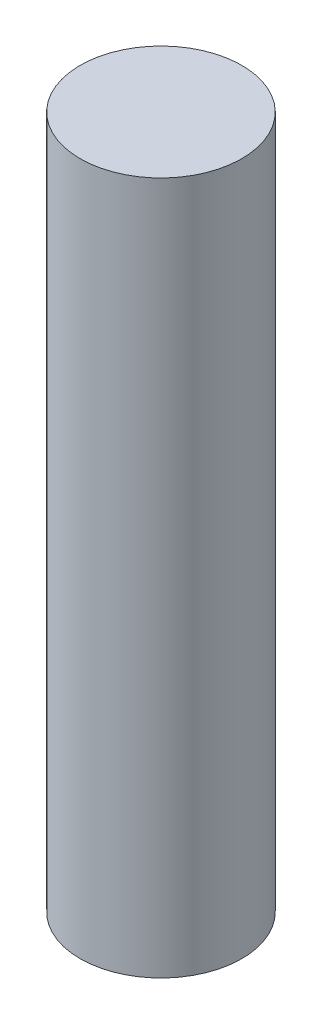
ISO-10303-21;
HEADER;
FILE_DESCRIPTION(('STEP AP214'),'2;1');
FILE_NAME('part.step','',(''),(''),'','','');
FILE_SCHEMA(('AUTOMOTIVE_DESIGN { 1 0 10303 214 1 1 1 1 }'));
ENDSEC;
DATA;
#1=APPLICATION_CONTEXT('core data for automotive mechanical design processes');
#2=APPLICATION_PROTOCOL_DEFINITION('international standard','automotive_design',2000,#1);
#3=PRODUCT_CONTEXT('',#1,'mechanical');
#4=PRODUCT('Part','Part','',(#3));
#5=PRODUCT_RELATED_PRODUCT_CATEGORY('part','',(#4));
#6=PRODUCT_DEFINITION_FORMATION('','',#4);
#7=PRODUCT_DEFINITION_CONTEXT('part definition',#1,'design');
#8=PRODUCT_DEFINITION('design','',#6,#7);
#9=PRODUCT_DEFINITION_SHAPE('','',#8);
#10=(LENGTH_UNIT() NAMED_UNIT(*) SI_UNIT(.MILLI.,.METRE.));
#11=(NAMED_UNIT(*) PLANE_ANGLE_UNIT() SI_UNIT($,.RADIAN.));
#12=(NAMED_UNIT(*) SI_UNIT($,.STERADIAN.) SOLID_ANGLE_UNIT());
#13=UNCERTAINTY_MEASURE_WITH_UNIT(LENGTH_MEASURE(1.E-05),#10,'distance_accuracy_value','');
#14=(GEOMETRIC_REPRESENTATION_CONTEXT(3) GLOBAL_UNCERTAINTY_ASSIGNED_CONTEXT((#13)) GLOBAL_UNIT_ASSIGNED_CONTEXT((#10,
#11,#12)) REPRESENTATION_CONTEXT('',''));
#15=CARTESIAN_POINT('',(0.,0.,0.));
#16=DIRECTION('',(0.,0.,1.));
#17=DIRECTION('',(1.,0.,0.));
#18=AXIS2_PLACEMENT_3D('',#15,#16,#17);
#19=CARTESIAN_POINT('',(0.,30.,0.));
#20=DIRECTION('',(0.,-1.,0.));
#21=DIRECTION('',(0.,0.,-1.));
#22=AXIS2_PLACEMENT_3D('',#19,#20,#21);
#23=CYLINDRICAL_SURFACE('',#22,3.5);
#24=CARTESIAN_POINT('',(0.,30.,0.));
#25=DIRECTION('',(0.,1.,0.));
#26=DIRECTION('',(0.,0.,1.));
#27=AXIS2_PLACEMENT_3D('',#24,#25,#26);
#28=CIRCLE('',#27,3.5);
#29=CARTESIAN_POINT('',(0.,30.,3.5));
#30=VERTEX_POINT('',#29);
#31=EDGE_CURVE('E10',#30,#30,#28,.T.);
#32=ORIENTED_EDGE('',*,*,#31,.F.);
#33=EDGE_LOOP('',(#32));
#34=FACE_BOUND('',#33,.T.);
#35=CARTESIAN_POINT('',(0.,0.,0.));
#36=DIRECTION('',(0.,1.,0.));
#37=DIRECTION('',(0.,0.,1.));
#38=AXIS2_PLACEMENT_3D('',#35,#36,#37);
#39=CIRCLE('',#38,3.5);
#40=CARTESIAN_POINT('',(0.,0.,3.5));
#41=VERTEX_POINT('',#40);
#42=EDGE_CURVE('E33',#41,#41,#39,.T.);
#43=ORIENTED_EDGE('',*,*,#42,.T.);
#44=EDGE_LOOP('',(#43));
#45=FACE_BOUND('',#44,.T.);
#46=ADVANCED_FACE('F30',(#34,#45),#23,.T.);
#47=CARTESIAN_POINT('',(0.,30.,0.));
#48=DIRECTION('',(0.,1.,0.));
#49=DIRECTION('',(0.,0.,1.));
#50=AXIS2_PLACEMENT_3D('',#47,#48,#49);
#51=PLANE('',#50);
#52=ORIENTED_EDGE('',*,*,#31,.T.);
#53=EDGE_LOOP('',(#52));
#54=FACE_BOUND('',#53,.T.);
#55=ADVANCED_FACE('F45',(#54),#51,.T.);
#56=CARTESIAN_POINT('',(0.,0.,0.));
#57=DIRECTION('',(0.,1.,0.));
#58=DIRECTION('',(0.,0.,1.));
#59=AXIS2_PLACEMENT_3D('',#56,#57,#58);
#60=PLANE('',#59);
#61=ORIENTED_EDGE('',*,*,#42,.F.);
#62=EDGE_LOOP('',(#61));
#63=FACE_BOUND('',#62,.T.);
#64=ADVANCED_FACE('F43',(#63),#60,.F.);
#65=CLOSED_SHELL('',(#46,#55,#64));
#66=MANIFOLD_SOLID_BREP('B2',#65);
#67=ADVANCED_BREP_SHAPE_REPRESENTATION('',(#18,#66),#14);
#68=SHAPE_DEFINITION_REPRESENTATION(#9,#67);
ENDSEC;
END-ISO-10303-21;
